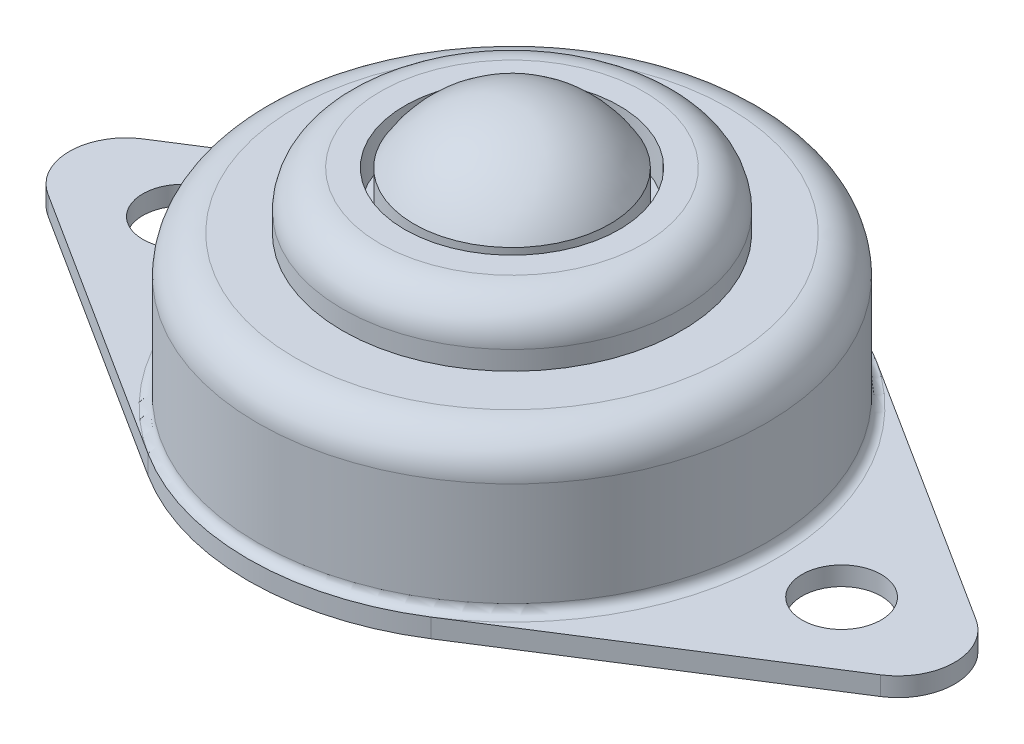
ISO-10303-21;
HEADER;
FILE_DESCRIPTION(('STEP AP214'),'2;1');
FILE_NAME('part.step','',(''),(''),'','','');
FILE_SCHEMA(('AUTOMOTIVE_DESIGN { 1 0 10303 214 1 1 1 1 }'));
ENDSEC;
DATA;
#1=APPLICATION_CONTEXT('core data for automotive mechanical design processes');
#2=APPLICATION_PROTOCOL_DEFINITION('international standard','automotive_design',2000,#1);
#3=PRODUCT_CONTEXT('',#1,'mechanical');
#4=PRODUCT('Part','Part','',(#3));
#5=PRODUCT_RELATED_PRODUCT_CATEGORY('part','',(#4));
#6=PRODUCT_DEFINITION_FORMATION('','',#4);
#7=PRODUCT_DEFINITION_CONTEXT('part definition',#1,'design');
#8=PRODUCT_DEFINITION('design','',#6,#7);
#9=PRODUCT_DEFINITION_SHAPE('','',#8);
#10=(LENGTH_UNIT() NAMED_UNIT(*) SI_UNIT(.MILLI.,.METRE.));
#11=(NAMED_UNIT(*) PLANE_ANGLE_UNIT() SI_UNIT($,.RADIAN.));
#12=(NAMED_UNIT(*) SI_UNIT($,.STERADIAN.) SOLID_ANGLE_UNIT());
#13=UNCERTAINTY_MEASURE_WITH_UNIT(LENGTH_MEASURE(1.E-05),#10,'distance_accuracy_value','');
#14=(GEOMETRIC_REPRESENTATION_CONTEXT(3) GLOBAL_UNCERTAINTY_ASSIGNED_CONTEXT((#13)) GLOBAL_UNIT_ASSIGNED_CONTEXT((#10,
#11,#12)) REPRESENTATION_CONTEXT('',''));
#15=CARTESIAN_POINT('',(0.,0.,0.));
#16=DIRECTION('',(0.,0.,1.));
#17=DIRECTION('',(1.,0.,0.));
#18=AXIS2_PLACEMENT_3D('',#15,#16,#17);
#19=CARTESIAN_POINT('',(0.,12.,0.));
#20=DIRECTION('',(0.,-1.,0.));
#21=DIRECTION('',(0.,0.,-1.));
#22=AXIS2_PLACEMENT_3D('',#19,#20,#21);
#23=CYLINDRICAL_SURFACE('',#22,13.5);
#24=CARTESIAN_POINT('',(0.,7.,0.));
#25=DIRECTION('',(0.,1.,0.));
#26=DIRECTION('',(0.,0.,1.));
#27=AXIS2_PLACEMENT_3D('',#24,#25,#26);
#28=CIRCLE('',#27,13.5);
#29=CARTESIAN_POINT('',(0.,7.,13.5));
#30=VERTEX_POINT('',#29);
#31=EDGE_CURVE('E11',#30,#30,#28,.F.);
#32=ORIENTED_EDGE('',*,*,#31,.T.);
#33=EDGE_LOOP('',(#32));
#34=FACE_BOUND('',#33,.T.);
#35=CARTESIAN_POINT('',(0.,1.5,0.));
#36=DIRECTION('',(0.,1.,0.));
#37=DIRECTION('',(0.,0.,1.));
#38=AXIS2_PLACEMENT_3D('',#35,#36,#37);
#39=CIRCLE('',#38,13.5);
#40=CARTESIAN_POINT('',(0.,1.5,13.5));
#41=VERTEX_POINT('',#40);
#42=EDGE_CURVE('E171',#41,#41,#39,.T.);
#43=ORIENTED_EDGE('',*,*,#42,.T.);
#44=EDGE_LOOP('',(#43));
#45=FACE_BOUND('',#44,.T.);
#46=ADVANCED_FACE('F40',(#34,#45),#23,.T.);
#47=CARTESIAN_POINT('',(0.,1.,0.));
#48=DIRECTION('',(0.,1.,0.));
#49=DIRECTION('',(0.,0.,1.));
#50=AXIS2_PLACEMENT_3D('',#47,#48,#49);
#51=PLANE('',#50);
#52=CARTESIAN_POINT('',(-17.5,1.,0.));
#53=DIRECTION('',(0.,1.,0.));
#54=DIRECTION('',(0.,0.,1.));
#55=AXIS2_PLACEMENT_3D('',#52,#53,#54);
#56=CIRCLE('',#55,2.1);
#57=CARTESIAN_POINT('',(-17.5,1.,2.1));
#58=VERTEX_POINT('',#57);
#59=EDGE_CURVE('E145',#58,#58,#56,.T.);
#60=ORIENTED_EDGE('',*,*,#59,.F.);
#61=EDGE_LOOP('',(#60));
#62=FACE_BOUND('',#61,.T.);
#63=DIRECTION('',(0.843846043512497,0.,0.536585365853659));
#64=VECTOR('',#63,1.);
#65=CARTESIAN_POINT('',(-22.109756097561,1.,2.53153813053749));
#66=LINE('',#65,#64);
#67=CARTESIAN_POINT('',(-22.109756097561,1.,2.53153813053749));
#68=VERTEX_POINT('',#67);
#69=CARTESIAN_POINT('',(-7.51219512195122,1.,11.813844609175));
#70=VERTEX_POINT('',#69);
#71=EDGE_CURVE('E312',#68,#70,#66,.T.);
#72=ORIENTED_EDGE('',*,*,#71,.T.);
#73=CARTESIAN_POINT('',(0.,1.,0.));
#74=DIRECTION('',(0.,1.,0.));
#75=DIRECTION('',(0.,0.,1.));
#76=AXIS2_PLACEMENT_3D('',#73,#74,#75);
#77=CIRCLE('',#76,14.);
#78=CARTESIAN_POINT('',(-7.51219512195122,1.,-11.813844609175));
#79=VERTEX_POINT('',#78);
#80=EDGE_CURVE('E175',#70,#79,#77,.F.);
#81=ORIENTED_EDGE('',*,*,#80,.T.);
#82=DIRECTION('',(-0.843846043512497,0.,0.536585365853659));
#83=VECTOR('',#82,1.);
#84=CARTESIAN_POINT('',(-22.109756097561,1.,-2.5315381305375));
#85=LINE('',#84,#83);
#86=CARTESIAN_POINT('',(-22.109756097561,1.,-2.5315381305375));
#87=VERTEX_POINT('',#86);
#88=EDGE_CURVE('E308',#79,#87,#85,.T.);
#89=ORIENTED_EDGE('',*,*,#88,.T.);
#90=CARTESIAN_POINT('',(-20.5,1.,0.));
#91=DIRECTION('',(0.,1.,0.));
#92=DIRECTION('',(0.,0.,1.));
#93=AXIS2_PLACEMENT_3D('',#90,#91,#92);
#94=CIRCLE('',#93,3.);
#95=EDGE_CURVE('E310',#87,#68,#94,.T.);
#96=ORIENTED_EDGE('',*,*,#95,.T.);
#97=EDGE_LOOP('',(#72,#81,#89,#96));
#98=FACE_BOUND('',#97,.T.);
#99=ADVANCED_FACE('F203',(#62,#98),#51,.T.);
#100=DIRECTION('',(-0.843846043512497,0.,-0.536585365853659));
#101=VECTOR('',#100,1.);
#102=CARTESIAN_POINT('',(22.109756097561,1.,-2.5315381305375));
#103=LINE('',#102,#101);
#104=CARTESIAN_POINT('',(22.109756097561,1.,-2.5315381305375));
#105=VERTEX_POINT('',#104);
#106=CARTESIAN_POINT('',(7.51219512195122,1.,-11.813844609175));
#107=VERTEX_POINT('',#106);
#108=EDGE_CURVE('E57',#105,#107,#103,.T.);
#109=ORIENTED_EDGE('',*,*,#108,.T.);
#110=CARTESIAN_POINT('',(0.,1.,0.));
#111=DIRECTION('',(0.,1.,0.));
#112=DIRECTION('',(0.,0.,1.));
#113=AXIS2_PLACEMENT_3D('',#110,#111,#112);
#114=CIRCLE('',#113,14.);
#115=CARTESIAN_POINT('',(7.51219512195122,1.,11.813844609175));
#116=VERTEX_POINT('',#115);
#117=EDGE_CURVE('E121',#107,#116,#114,.F.);
#118=ORIENTED_EDGE('',*,*,#117,.T.);
#119=DIRECTION('',(0.843846043512497,0.,-0.536585365853659));
#120=VECTOR('',#119,1.);
#121=CARTESIAN_POINT('',(22.109756097561,1.,2.53153813053749));
#122=LINE('',#121,#120);
#123=CARTESIAN_POINT('',(22.109756097561,1.,2.53153813053749));
#124=VERTEX_POINT('',#123);
#125=EDGE_CURVE('E115',#116,#124,#122,.T.);
#126=ORIENTED_EDGE('',*,*,#125,.T.);
#127=CARTESIAN_POINT('',(20.5,1.,0.));
#128=DIRECTION('',(0.,1.,0.));
#129=DIRECTION('',(0.,0.,-1.));
#130=AXIS2_PLACEMENT_3D('',#127,#128,#129);
#131=CIRCLE('',#130,3.);
#132=EDGE_CURVE('E120',#124,#105,#131,.T.);
#133=ORIENTED_EDGE('',*,*,#132,.T.);
#134=EDGE_LOOP('',(#109,#118,#126,#133));
#135=FACE_BOUND('',#134,.T.);
#136=CARTESIAN_POINT('',(17.5,1.,0.));
#137=DIRECTION('',(0.,1.,0.));
#138=DIRECTION('',(0.,0.,-1.));
#139=AXIS2_PLACEMENT_3D('',#136,#137,#138);
#140=CIRCLE('',#139,2.1);
#141=CARTESIAN_POINT('',(17.5,1.,-2.1));
#142=VERTEX_POINT('',#141);
#143=EDGE_CURVE('E297',#142,#142,#140,.T.);
#144=ORIENTED_EDGE('',*,*,#143,.F.);
#145=EDGE_LOOP('',(#144));
#146=FACE_BOUND('',#145,.T.);
#147=ADVANCED_FACE('F117',(#135,#146),#51,.T.);
#148=CARTESIAN_POINT('',(0.,0.,0.));
#149=DIRECTION('',(0.,1.,0.));
#150=DIRECTION('',(0.,0.,1.));
#151=AXIS2_PLACEMENT_3D('',#148,#149,#150);
#152=PLANE('',#151);
#153=CARTESIAN_POINT('',(0.,0.,0.));
#154=DIRECTION('',(0.,1.,0.));
#155=DIRECTION('',(0.,0.,1.));
#156=AXIS2_PLACEMENT_3D('',#153,#154,#155);
#157=CIRCLE('',#156,14.);
#158=CARTESIAN_POINT('',(7.51219512195122,0.,-11.813844609175));
#159=VERTEX_POINT('',#158);
#160=CARTESIAN_POINT('',(-7.51219512195122,0.,-11.813844609175));
#161=VERTEX_POINT('',#160);
#162=EDGE_CURVE('E141',#159,#161,#157,.T.);
#163=ORIENTED_EDGE('',*,*,#162,.F.);
#164=DIRECTION('',(-0.843846043512497,0.,-0.536585365853659));
#165=VECTOR('',#164,1.);
#166=CARTESIAN_POINT('',(22.109756097561,0.,-2.5315381305375));
#167=LINE('',#166,#165);
#168=CARTESIAN_POINT('',(22.109756097561,0.,-2.5315381305375));
#169=VERTEX_POINT('',#168);
#170=EDGE_CURVE('E92',#169,#159,#167,.T.);
#171=ORIENTED_EDGE('',*,*,#170,.F.);
#172=CARTESIAN_POINT('',(20.5,0.,0.));
#173=DIRECTION('',(0.,1.,0.));
#174=DIRECTION('',(0.,0.,-1.));
#175=AXIS2_PLACEMENT_3D('',#172,#173,#174);
#176=CIRCLE('',#175,3.);
#177=CARTESIAN_POINT('',(22.109756097561,0.,2.53153813053749));
#178=VERTEX_POINT('',#177);
#179=EDGE_CURVE('E86',#178,#169,#176,.T.);
#180=ORIENTED_EDGE('',*,*,#179,.F.);
#181=DIRECTION('',(0.843846043512497,0.,-0.536585365853659));
#182=VECTOR('',#181,1.);
#183=CARTESIAN_POINT('',(22.109756097561,0.,2.53153813053749));
#184=LINE('',#183,#182);
#185=CARTESIAN_POINT('',(7.51219512195122,0.,11.813844609175));
#186=VERTEX_POINT('',#185);
#187=EDGE_CURVE('E131',#186,#178,#184,.T.);
#188=ORIENTED_EDGE('',*,*,#187,.F.);
#189=CARTESIAN_POINT('',(0.,0.,0.));
#190=DIRECTION('',(0.,1.,0.));
#191=DIRECTION('',(0.,0.,1.));
#192=AXIS2_PLACEMENT_3D('',#189,#190,#191);
#193=CIRCLE('',#192,14.);
#194=CARTESIAN_POINT('',(-7.51219512195122,0.,11.813844609175));
#195=VERTEX_POINT('',#194);
#196=EDGE_CURVE('E151',#195,#186,#193,.T.);
#197=ORIENTED_EDGE('',*,*,#196,.F.);
#198=DIRECTION('',(0.843846043512497,0.,0.536585365853659));
#199=VECTOR('',#198,1.);
#200=CARTESIAN_POINT('',(-22.109756097561,0.,2.53153813053749));
#201=LINE('',#200,#199);
#202=CARTESIAN_POINT('',(-22.109756097561,0.,2.53153813053749));
#203=VERTEX_POINT('',#202);
#204=EDGE_CURVE('E149',#203,#195,#201,.T.);
#205=ORIENTED_EDGE('',*,*,#204,.F.);
#206=CARTESIAN_POINT('',(-20.5,0.,0.));
#207=DIRECTION('',(0.,1.,0.));
#208=DIRECTION('',(0.,0.,1.));
#209=AXIS2_PLACEMENT_3D('',#206,#207,#208);
#210=CIRCLE('',#209,3.);
#211=CARTESIAN_POINT('',(-22.109756097561,0.,-2.5315381305375));
#212=VERTEX_POINT('',#211);
#213=EDGE_CURVE('E147',#212,#203,#210,.T.);
#214=ORIENTED_EDGE('',*,*,#213,.F.);
#215=DIRECTION('',(-0.843846043512497,0.,0.536585365853659));
#216=VECTOR('',#215,1.);
#217=CARTESIAN_POINT('',(-22.109756097561,0.,-2.5315381305375));
#218=LINE('',#217,#216);
#219=EDGE_CURVE('E144',#161,#212,#218,.T.);
#220=ORIENTED_EDGE('',*,*,#219,.F.);
#221=EDGE_LOOP('',(#163,#171,#180,#188,#197,#205,#214,#220));
#222=FACE_BOUND('',#221,.T.);
#223=CARTESIAN_POINT('',(-17.5,0.,0.));
#224=DIRECTION('',(0.,1.,0.));
#225=DIRECTION('',(0.,0.,1.));
#226=AXIS2_PLACEMENT_3D('',#223,#224,#225);
#227=CIRCLE('',#226,2.1);
#228=CARTESIAN_POINT('',(-17.5,0.,2.1));
#229=VERTEX_POINT('',#228);
#230=EDGE_CURVE('E300',#229,#229,#227,.T.);
#231=ORIENTED_EDGE('',*,*,#230,.T.);
#232=EDGE_LOOP('',(#231));
#233=FACE_BOUND('',#232,.T.);
#234=CARTESIAN_POINT('',(17.5,0.,0.));
#235=DIRECTION('',(0.,1.,0.));
#236=DIRECTION('',(0.,0.,-1.));
#237=AXIS2_PLACEMENT_3D('',#234,#235,#236);
#238=CIRCLE('',#237,2.1);
#239=CARTESIAN_POINT('',(17.5,0.,-2.1));
#240=VERTEX_POINT('',#239);
#241=EDGE_CURVE('E296',#240,#240,#238,.T.);
#242=ORIENTED_EDGE('',*,*,#241,.T.);
#243=EDGE_LOOP('',(#242));
#244=FACE_BOUND('',#243,.T.);
#245=ADVANCED_FACE('F226',(#222,#233,#244),#152,.F.);
#246=CARTESIAN_POINT('',(0.,1.,0.));
#247=DIRECTION('',(0.,-1.,0.));
#248=DIRECTION('',(0.,0.,-1.));
#249=AXIS2_PLACEMENT_3D('',#246,#247,#248);
#250=CYLINDRICAL_SURFACE('',#249,14.);
#251=ORIENTED_EDGE('',*,*,#162,.T.);
#252=DIRECTION('',(0.,-1.,0.));
#253=VECTOR('',#252,1.);
#254=CARTESIAN_POINT('',(-7.51219512195122,1.,-11.813844609175));
#255=LINE('',#254,#253);
#256=EDGE_CURVE('E168',#79,#161,#255,.T.);
#257=ORIENTED_EDGE('',*,*,#256,.F.);
#258=CARTESIAN_POINT('',(0.,1.,0.));
#259=DIRECTION('',(0.,1.,0.));
#260=DIRECTION('',(0.,0.,1.));
#261=AXIS2_PLACEMENT_3D('',#258,#259,#260);
#262=CIRCLE('',#261,14.);
#263=EDGE_CURVE('E101',#107,#79,#262,.T.);
#264=ORIENTED_EDGE('',*,*,#263,.F.);
#265=DIRECTION('',(0.,-1.,0.));
#266=VECTOR('',#265,1.);
#267=CARTESIAN_POINT('',(7.51219512195122,1.,-11.813844609175));
#268=LINE('',#267,#266);
#269=EDGE_CURVE('E137',#107,#159,#268,.T.);
#270=ORIENTED_EDGE('',*,*,#269,.T.);
#271=EDGE_LOOP('',(#251,#257,#264,#270));
#272=FACE_BOUND('',#271,.T.);
#273=ADVANCED_FACE('F229',(#272),#250,.T.);
#274=CARTESIAN_POINT('',(-22.109756097561,1.,-2.5315381305375));
#275=DIRECTION('',(0.536585365853659,0.,0.843846043512497));
#276=DIRECTION('',(0.843846043512497,0.,-0.536585365853659));
#277=AXIS2_PLACEMENT_3D('',#274,#275,#276);
#278=PLANE('',#277);
#279=ORIENTED_EDGE('',*,*,#219,.T.);
#280=DIRECTION('',(0.,-1.,0.));
#281=VECTOR('',#280,1.);
#282=CARTESIAN_POINT('',(-22.109756097561,1.,-2.5315381305375));
#283=LINE('',#282,#281);
#284=EDGE_CURVE('E165',#87,#212,#283,.T.);
#285=ORIENTED_EDGE('',*,*,#284,.F.);
#286=ORIENTED_EDGE('',*,*,#88,.F.);
#287=ORIENTED_EDGE('',*,*,#256,.T.);
#288=EDGE_LOOP('',(#279,#285,#286,#287));
#289=FACE_BOUND('',#288,.T.);
#290=ADVANCED_FACE('F248',(#289),#278,.F.);
#291=CARTESIAN_POINT('',(-20.5,1.,0.));
#292=DIRECTION('',(0.,-1.,0.));
#293=DIRECTION('',(0.,0.,-1.));
#294=AXIS2_PLACEMENT_3D('',#291,#292,#293);
#295=CYLINDRICAL_SURFACE('',#294,3.);
#296=ORIENTED_EDGE('',*,*,#213,.T.);
#297=DIRECTION('',(0.,-1.,0.));
#298=VECTOR('',#297,1.);
#299=CARTESIAN_POINT('',(-22.109756097561,1.,2.53153813053749));
#300=LINE('',#299,#298);
#301=EDGE_CURVE('E162',#68,#203,#300,.T.);
#302=ORIENTED_EDGE('',*,*,#301,.F.);
#303=ORIENTED_EDGE('',*,*,#95,.F.);
#304=ORIENTED_EDGE('',*,*,#284,.T.);
#305=EDGE_LOOP('',(#296,#302,#303,#304));
#306=FACE_BOUND('',#305,.T.);
#307=ADVANCED_FACE('F244',(#306),#295,.T.);
#308=CARTESIAN_POINT('',(-22.109756097561,1.,2.53153813053749));
#309=DIRECTION('',(0.536585365853659,0.,-0.843846043512497));
#310=DIRECTION('',(-0.843846043512497,0.,-0.536585365853659));
#311=AXIS2_PLACEMENT_3D('',#308,#309,#310);
#312=PLANE('',#311);
#313=ORIENTED_EDGE('',*,*,#204,.T.);
#314=DIRECTION('',(0.,-1.,0.));
#315=VECTOR('',#314,1.);
#316=CARTESIAN_POINT('',(-7.51219512195122,1.,11.813844609175));
#317=LINE('',#316,#315);
#318=EDGE_CURVE('E159',#70,#195,#317,.T.);
#319=ORIENTED_EDGE('',*,*,#318,.F.);
#320=ORIENTED_EDGE('',*,*,#71,.F.);
#321=ORIENTED_EDGE('',*,*,#301,.T.);
#322=EDGE_LOOP('',(#313,#319,#320,#321));
#323=FACE_BOUND('',#322,.T.);
#324=ADVANCED_FACE('F240',(#323),#312,.F.);
#325=CARTESIAN_POINT('',(0.,1.,0.));
#326=DIRECTION('',(0.,-1.,0.));
#327=DIRECTION('',(0.,0.,-1.));
#328=AXIS2_PLACEMENT_3D('',#325,#326,#327);
#329=CYLINDRICAL_SURFACE('',#328,14.);
#330=ORIENTED_EDGE('',*,*,#196,.T.);
#331=DIRECTION('',(0.,-1.,0.));
#332=VECTOR('',#331,1.);
#333=CARTESIAN_POINT('',(7.51219512195122,1.,11.813844609175));
#334=LINE('',#333,#332);
#335=EDGE_CURVE('E132',#116,#186,#334,.T.);
#336=ORIENTED_EDGE('',*,*,#335,.F.);
#337=CARTESIAN_POINT('',(0.,1.,0.));
#338=DIRECTION('',(0.,1.,0.));
#339=DIRECTION('',(0.,0.,1.));
#340=AXIS2_PLACEMENT_3D('',#337,#338,#339);
#341=CIRCLE('',#340,14.);
#342=EDGE_CURVE('E126',#70,#116,#341,.T.);
#343=ORIENTED_EDGE('',*,*,#342,.F.);
#344=ORIENTED_EDGE('',*,*,#318,.T.);
#345=EDGE_LOOP('',(#330,#336,#343,#344));
#346=FACE_BOUND('',#345,.T.);
#347=ADVANCED_FACE('F237',(#346),#329,.T.);
#348=CARTESIAN_POINT('',(22.109756097561,1.,2.53153813053749));
#349=DIRECTION('',(-0.536585365853659,0.,-0.843846043512497));
#350=DIRECTION('',(-0.843846043512497,0.,0.536585365853659));
#351=AXIS2_PLACEMENT_3D('',#348,#349,#350);
#352=PLANE('',#351);
#353=ORIENTED_EDGE('',*,*,#187,.T.);
#354=DIRECTION('',(0.,-1.,0.));
#355=VECTOR('',#354,1.);
#356=CARTESIAN_POINT('',(22.109756097561,1.,2.53153813053749));
#357=LINE('',#356,#355);
#358=EDGE_CURVE('E128',#124,#178,#357,.T.);
#359=ORIENTED_EDGE('',*,*,#358,.F.);
#360=ORIENTED_EDGE('',*,*,#125,.F.);
#361=ORIENTED_EDGE('',*,*,#335,.T.);
#362=EDGE_LOOP('',(#353,#359,#360,#361));
#363=FACE_BOUND('',#362,.T.);
#364=ADVANCED_FACE('F129',(#363),#352,.F.);
#365=CARTESIAN_POINT('',(20.5,1.,0.));
#366=DIRECTION('',(0.,-1.,0.));
#367=DIRECTION('',(0.,0.,-1.));
#368=AXIS2_PLACEMENT_3D('',#365,#366,#367);
#369=CYLINDRICAL_SURFACE('',#368,3.);
#370=ORIENTED_EDGE('',*,*,#179,.T.);
#371=DIRECTION('',(0.,-1.,0.));
#372=VECTOR('',#371,1.);
#373=CARTESIAN_POINT('',(22.109756097561,1.,-2.5315381305375));
#374=LINE('',#373,#372);
#375=EDGE_CURVE('E133',#105,#169,#374,.T.);
#376=ORIENTED_EDGE('',*,*,#375,.F.);
#377=ORIENTED_EDGE('',*,*,#132,.F.);
#378=ORIENTED_EDGE('',*,*,#358,.T.);
#379=EDGE_LOOP('',(#370,#376,#377,#378));
#380=FACE_BOUND('',#379,.T.);
#381=ADVANCED_FACE('F135',(#380),#369,.T.);
#382=CARTESIAN_POINT('',(22.109756097561,1.,-2.5315381305375));
#383=DIRECTION('',(-0.536585365853659,0.,0.843846043512497));
#384=DIRECTION('',(0.843846043512497,0.,0.536585365853659));
#385=AXIS2_PLACEMENT_3D('',#382,#383,#384);
#386=PLANE('',#385);
#387=ORIENTED_EDGE('',*,*,#170,.T.);
#388=ORIENTED_EDGE('',*,*,#269,.F.);
#389=ORIENTED_EDGE('',*,*,#108,.F.);
#390=ORIENTED_EDGE('',*,*,#375,.T.);
#391=EDGE_LOOP('',(#387,#388,#389,#390));
#392=FACE_BOUND('',#391,.T.);
#393=ADVANCED_FACE('F222',(#392),#386,.F.);
#394=CARTESIAN_POINT('',(-17.5,1.,0.));
#395=DIRECTION('',(0.,-1.,0.));
#396=DIRECTION('',(0.,0.,-1.));
#397=AXIS2_PLACEMENT_3D('',#394,#395,#396);
#398=CYLINDRICAL_SURFACE('',#397,2.1);
#399=ORIENTED_EDGE('',*,*,#59,.T.);
#400=EDGE_LOOP('',(#399));
#401=FACE_BOUND('',#400,.T.);
#402=ORIENTED_EDGE('',*,*,#230,.F.);
#403=EDGE_LOOP('',(#402));
#404=FACE_BOUND('',#403,.T.);
#405=ADVANCED_FACE('F219',(#401,#404),#398,.F.);
#406=CARTESIAN_POINT('',(17.5,1.,0.));
#407=DIRECTION('',(0.,-1.,0.));
#408=DIRECTION('',(0.,0.,-1.));
#409=AXIS2_PLACEMENT_3D('',#406,#407,#408);
#410=CYLINDRICAL_SURFACE('',#409,2.1);
#411=ORIENTED_EDGE('',*,*,#143,.T.);
#412=EDGE_LOOP('',(#411));
#413=FACE_BOUND('',#412,.T.);
#414=ORIENTED_EDGE('',*,*,#241,.F.);
#415=EDGE_LOOP('',(#414));
#416=FACE_BOUND('',#415,.T.);
#417=ADVANCED_FACE('F215',(#413,#416),#410,.F.);
#418=CARTESIAN_POINT('',(0.,1.5,0.));
#419=DIRECTION('',(0.,1.,0.));
#420=DIRECTION('',(0.,0.,1.));
#421=AXIS2_PLACEMENT_3D('',#418,#419,#420);
#422=TOROIDAL_SURFACE('',#421,14.,0.5);
#423=ORIENTED_EDGE('',*,*,#263,.T.);
#424=ORIENTED_EDGE('',*,*,#80,.F.);
#425=ORIENTED_EDGE('',*,*,#342,.T.);
#426=ORIENTED_EDGE('',*,*,#117,.F.);
#427=EDGE_LOOP('',(#423,#424,#425,#426));
#428=FACE_BOUND('',#427,.T.);
#429=ORIENTED_EDGE('',*,*,#42,.F.);
#430=EDGE_LOOP('',(#429));
#431=FACE_BOUND('',#430,.T.);
#432=ADVANCED_FACE('F218',(#428,#431),#422,.F.);
#433=CARTESIAN_POINT('',(0.,9.,0.));
#434=DIRECTION('',(0.,1.,0.));
#435=DIRECTION('',(0.,0.,1.));
#436=AXIS2_PLACEMENT_3D('',#433,#434,#435);
#437=PLANE('',#436);
#438=CARTESIAN_POINT('',(0.,9.,0.));
#439=DIRECTION('',(0.,1.,0.));
#440=DIRECTION('',(0.,0.,1.));
#441=AXIS2_PLACEMENT_3D('',#438,#439,#440);
#442=CIRCLE('',#441,11.5);
#443=CARTESIAN_POINT('',(0.,9.,11.5));
#444=VERTEX_POINT('',#443);
#445=EDGE_CURVE('E49',#444,#444,#442,.T.);
#446=ORIENTED_EDGE('',*,*,#445,.T.);
#447=EDGE_LOOP('',(#446));
#448=FACE_BOUND('',#447,.T.);
#449=CARTESIAN_POINT('',(0.,9.,0.));
#450=DIRECTION('',(0.,1.,0.));
#451=DIRECTION('',(0.,0.,1.));
#452=AXIS2_PLACEMENT_3D('',#449,#450,#451);
#453=CIRCLE('',#452,9.);
#454=CARTESIAN_POINT('',(0.,9.,9.));
#455=VERTEX_POINT('',#454);
#456=EDGE_CURVE('E291',#455,#455,#453,.T.);
#457=ORIENTED_EDGE('',*,*,#456,.F.);
#458=EDGE_LOOP('',(#457));
#459=FACE_BOUND('',#458,.T.);
#460=ADVANCED_FACE('F185',(#448,#459),#437,.T.);
#461=CARTESIAN_POINT('',(0.,9.,0.));
#462=DIRECTION('',(0.,1.,0.));
#463=DIRECTION('',(0.,0.,1.));
#464=AXIS2_PLACEMENT_3D('',#461,#462,#463);
#465=CYLINDRICAL_SURFACE('',#464,9.);
#466=CARTESIAN_POINT('',(0.,10.,0.));
#467=DIRECTION('',(0.,1.,0.));
#468=DIRECTION('',(0.,0.,1.));
#469=AXIS2_PLACEMENT_3D('',#466,#467,#468);
#470=CIRCLE('',#469,9.);
#471=CARTESIAN_POINT('',(0.,10.,9.));
#472=VERTEX_POINT('',#471);
#473=EDGE_CURVE('E180',#472,#472,#470,.F.);
#474=ORIENTED_EDGE('',*,*,#473,.T.);
#475=EDGE_LOOP('',(#474));
#476=FACE_BOUND('',#475,.T.);
#477=ORIENTED_EDGE('',*,*,#456,.T.);
#478=EDGE_LOOP('',(#477));
#479=FACE_BOUND('',#478,.T.);
#480=ADVANCED_FACE('F260',(#476,#479),#465,.T.);
#481=CARTESIAN_POINT('',(0.,12.,0.));
#482=DIRECTION('',(0.,1.,0.));
#483=DIRECTION('',(0.,0.,1.));
#484=AXIS2_PLACEMENT_3D('',#481,#482,#483);
#485=PLANE('',#484);
#486=CARTESIAN_POINT('',(0.,12.,0.));
#487=DIRECTION('',(0.,1.,0.));
#488=DIRECTION('',(0.,0.,1.));
#489=AXIS2_PLACEMENT_3D('',#486,#487,#488);
#490=CIRCLE('',#489,5.69615242270663);
#491=CARTESIAN_POINT('',(0.,12.,5.69615242270663));
#492=VERTEX_POINT('',#491);
#493=EDGE_CURVE('E285',#492,#492,#490,.T.);
#494=ORIENTED_EDGE('',*,*,#493,.F.);
#495=EDGE_LOOP('',(#494));
#496=FACE_BOUND('',#495,.T.);
#497=CARTESIAN_POINT('',(0.,12.,0.));
#498=DIRECTION('',(0.,1.,0.));
#499=DIRECTION('',(0.,0.,1.));
#500=AXIS2_PLACEMENT_3D('',#497,#498,#499);
#501=CIRCLE('',#500,7.);
#502=CARTESIAN_POINT('',(0.,12.,7.));
#503=VERTEX_POINT('',#502);
#504=EDGE_CURVE('E177',#503,#503,#501,.T.);
#505=ORIENTED_EDGE('',*,*,#504,.T.);
#506=EDGE_LOOP('',(#505));
#507=FACE_BOUND('',#506,.T.);
#508=ADVANCED_FACE('F199',(#496,#507),#485,.T.);
#509=CARTESIAN_POINT('',(0.,10.,0.));
#510=DIRECTION('',(0.,1.,0.));
#511=DIRECTION('',(0.,0.,1.));
#512=AXIS2_PLACEMENT_3D('',#509,#510,#511);
#513=TOROIDAL_SURFACE('',#512,7.,2.);
#514=ORIENTED_EDGE('',*,*,#473,.F.);
#515=EDGE_LOOP('',(#514));
#516=FACE_BOUND('',#515,.T.);
#517=ORIENTED_EDGE('',*,*,#504,.F.);
#518=EDGE_LOOP('',(#517));
#519=FACE_BOUND('',#518,.T.);
#520=ADVANCED_FACE('F190',(#516,#519),#513,.T.);
#521=CARTESIAN_POINT('',(0.,7.,0.));
#522=DIRECTION('',(0.,1.,0.));
#523=DIRECTION('',(0.,0.,1.));
#524=AXIS2_PLACEMENT_3D('',#521,#522,#523);
#525=TOROIDAL_SURFACE('',#524,11.5,2.);
#526=ORIENTED_EDGE('',*,*,#31,.F.);
#527=EDGE_LOOP('',(#526));
#528=FACE_BOUND('',#527,.T.);
#529=ORIENTED_EDGE('',*,*,#445,.F.);
#530=EDGE_LOOP('',(#529));
#531=FACE_BOUND('',#530,.T.);
#532=ADVANCED_FACE('F42',(#528,#531),#525,.T.);
#533=CARTESIAN_POINT('',(0.,10.,0.));
#534=DIRECTION('',(0.,1.,0.));
#535=DIRECTION('',(0.,0.,1.));
#536=AXIS2_PLACEMENT_3D('',#533,#534,#535);
#537=CYLINDRICAL_SURFACE('',#536,5.69615242270663);
#538=CARTESIAN_POINT('',(0.,10.,0.));
#539=DIRECTION('',(0.,1.,0.));
#540=DIRECTION('',(0.,0.,1.));
#541=AXIS2_PLACEMENT_3D('',#538,#539,#540);
#542=CIRCLE('',#541,5.69615242270663);
#543=CARTESIAN_POINT('',(0.,10.,5.69615242270663));
#544=VERTEX_POINT('',#543);
#545=EDGE_CURVE('E288',#544,#544,#542,.T.);
#546=ORIENTED_EDGE('',*,*,#545,.F.);
#547=EDGE_LOOP('',(#546));
#548=FACE_BOUND('',#547,.T.);
#549=ORIENTED_EDGE('',*,*,#493,.T.);
#550=EDGE_LOOP('',(#549));
#551=FACE_BOUND('',#550,.T.);
#552=ADVANCED_FACE('F189',(#548,#551),#537,.F.);
#553=CARTESIAN_POINT('',(0.,10.,0.));
#554=DIRECTION('',(0.,1.,0.));
#555=DIRECTION('',(0.,0.,1.));
#556=AXIS2_PLACEMENT_3D('',#553,#554,#555);
#557=PLANE('',#556);
#558=CARTESIAN_POINT('',(0.,10.,0.));
#559=DIRECTION('',(0.,1.,0.));
#560=DIRECTION('',(0.,0.,1.));
#561=AXIS2_PLACEMENT_3D('',#558,#559,#560);
#562=CIRCLE('',#561,5.19615242270663);
#563=CARTESIAN_POINT('',(0.,10.,5.19615242270663));
#564=VERTEX_POINT('',#563);
#565=EDGE_CURVE('E282',#564,#564,#562,.T.);
#566=ORIENTED_EDGE('',*,*,#565,.F.);
#567=EDGE_LOOP('',(#566));
#568=FACE_BOUND('',#567,.T.);
#569=ORIENTED_EDGE('',*,*,#545,.T.);
#570=EDGE_LOOP('',(#569));
#571=FACE_BOUND('',#570,.T.);
#572=ADVANCED_FACE('F196',(#568,#571),#557,.T.);
#573=CARTESIAN_POINT('',(0.,10.,0.));
#574=DIRECTION('',(0.,1.,0.));
#575=DIRECTION('',(0.,0.,1.));
#576=AXIS2_PLACEMENT_3D('',#573,#574,#575);
#577=CYLINDRICAL_SURFACE('',#576,5.19615242270663);
#578=ORIENTED_EDGE('',*,*,#565,.T.);
#579=EDGE_LOOP('',(#578));
#580=FACE_BOUND('',#579,.T.);
#581=CARTESIAN_POINT('',(0.,12.,0.));
#582=DIRECTION('',(0.,1.,0.));
#583=DIRECTION('',(0.,0.,1.));
#584=AXIS2_PLACEMENT_3D('',#581,#582,#583);
#585=CIRCLE('',#584,5.19615242270663);
#586=CARTESIAN_POINT('',(0.,12.,5.19615242270663));
#587=VERTEX_POINT('',#586);
#588=EDGE_CURVE('E280',#587,#587,#585,.T.);
#589=ORIENTED_EDGE('',*,*,#588,.F.);
#590=EDGE_LOOP('',(#589));
#591=FACE_BOUND('',#590,.T.);
#592=ADVANCED_FACE('F271',(#580,#591),#577,.T.);
#593=CARTESIAN_POINT('',(0.,9.,0.));
#594=DIRECTION('',(0.,-1.,0.));
#595=DIRECTION('',(-1.,0.,0.));
#596=AXIS2_PLACEMENT_3D('',#593,#594,#595);
#597=SPHERICAL_SURFACE('',#596,6.);
#598=ORIENTED_EDGE('',*,*,#588,.T.);
#599=EDGE_LOOP('',(#598));
#600=FACE_BOUND('',#599,.T.);
#601=ADVANCED_FACE('F269',(#600),#597,.T.);
#602=CLOSED_SHELL('',(#46,#99,#147,#245,#273,#290,#307,#324,#347,#364,#381,#393,#405,#417,#432,
#460,#480,#508,#520,#532,#552,#572,#592,#601));
#603=MANIFOLD_SOLID_BREP('B2',#602);
#604=ADVANCED_BREP_SHAPE_REPRESENTATION('',(#18,#603),#14);
#605=SHAPE_DEFINITION_REPRESENTATION(#9,#604);
ENDSEC;
END-ISO-10303-21;
